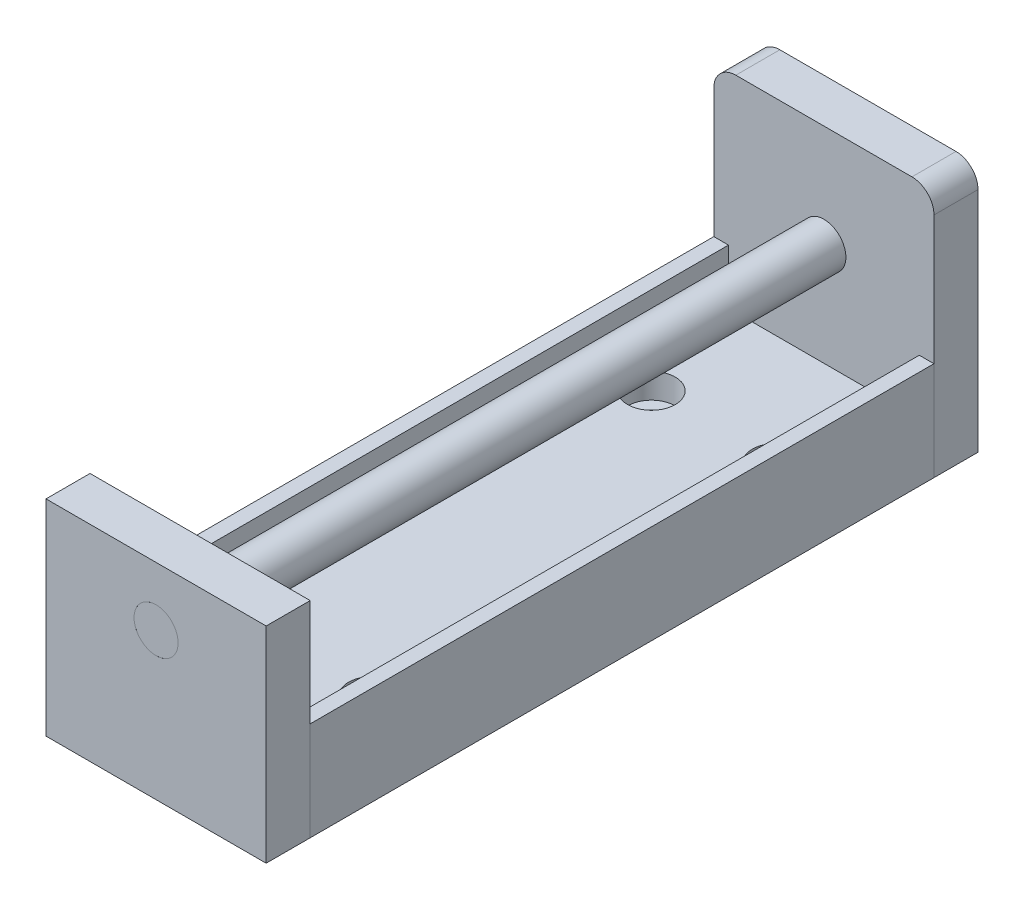
ISO-10303-21;
HEADER;
FILE_DESCRIPTION(('STEP AP214'),'2;1');
FILE_NAME('part.step','',(''),(''),'','','');
FILE_SCHEMA(('AUTOMOTIVE_DESIGN { 1 0 10303 214 1 1 1 1 }'));
ENDSEC;
DATA;
#1=APPLICATION_CONTEXT('core data for automotive mechanical design processes');
#2=APPLICATION_PROTOCOL_DEFINITION('international standard','automotive_design',2000,#1);
#3=PRODUCT_CONTEXT('',#1,'mechanical');
#4=PRODUCT('Part','Part','',(#3));
#5=PRODUCT_RELATED_PRODUCT_CATEGORY('part','',(#4));
#6=PRODUCT_DEFINITION_FORMATION('','',#4);
#7=PRODUCT_DEFINITION_CONTEXT('part definition',#1,'design');
#8=PRODUCT_DEFINITION('design','',#6,#7);
#9=PRODUCT_DEFINITION_SHAPE('','',#8);
#10=(LENGTH_UNIT() NAMED_UNIT(*) SI_UNIT(.MILLI.,.METRE.));
#11=(NAMED_UNIT(*) PLANE_ANGLE_UNIT() SI_UNIT($,.RADIAN.));
#12=(NAMED_UNIT(*) SI_UNIT($,.STERADIAN.) SOLID_ANGLE_UNIT());
#13=UNCERTAINTY_MEASURE_WITH_UNIT(LENGTH_MEASURE(1.E-05),#10,'distance_accuracy_value','');
#14=(GEOMETRIC_REPRESENTATION_CONTEXT(3) GLOBAL_UNCERTAINTY_ASSIGNED_CONTEXT((#13)) GLOBAL_UNIT_ASSIGNED_CONTEXT((#10,
#11,#12)) REPRESENTATION_CONTEXT('',''));
#15=CARTESIAN_POINT('',(0.,0.,0.));
#16=DIRECTION('',(0.,0.,1.));
#17=DIRECTION('',(1.,0.,0.));
#18=AXIS2_PLACEMENT_3D('',#15,#16,#17);
#19=CARTESIAN_POINT('',(0.,0.,6.51471862576143));
#20=DIRECTION('',(0.,0.,1.));
#21=DIRECTION('',(1.,0.,0.));
#22=AXIS2_PLACEMENT_3D('',#19,#20,#21);
#23=CYLINDRICAL_SURFACE('',#22,3.);
#24=CARTESIAN_POINT('',(0.,0.,15.));
#25=DIRECTION('',(0.,0.,1.));
#26=DIRECTION('',(1.,0.,0.));
#27=AXIS2_PLACEMENT_3D('',#24,#25,#26);
#28=CIRCLE('',#27,3.);
#29=CARTESIAN_POINT('',(3.,0.,15.));
#30=VERTEX_POINT('',#29);
#31=EDGE_CURVE('E11',#30,#30,#28,.F.);
#32=ORIENTED_EDGE('',*,*,#31,.F.);
#33=EDGE_LOOP('',(#32));
#34=FACE_BOUND('',#33,.T.);
#35=CARTESIAN_POINT('',(0.,0.,112.));
#36=DIRECTION('',(0.,0.,-1.));
#37=DIRECTION('',(-1.,0.,0.));
#38=AXIS2_PLACEMENT_3D('',#35,#36,#37);
#39=CIRCLE('',#38,3.);
#40=CARTESIAN_POINT('',(-3.,0.,112.));
#41=VERTEX_POINT('',#40);
#42=EDGE_CURVE('E56',#41,#41,#39,.T.);
#43=ORIENTED_EDGE('',*,*,#42,.T.);
#44=EDGE_LOOP('',(#43));
#45=FACE_BOUND('',#44,.T.);
#46=ADVANCED_FACE('F49',(#34,#45),#23,.T.);
#47=CARTESIAN_POINT('',(0.,0.,15.));
#48=DIRECTION('',(0.,0.,1.));
#49=DIRECTION('',(1.,0.,0.));
#50=AXIS2_PLACEMENT_3D('',#47,#48,#49);
#51=PLANE('',#50);
#52=ORIENTED_EDGE('',*,*,#31,.T.);
#53=EDGE_LOOP('',(#52));
#54=FACE_BOUND('',#53,.T.);
#55=ADVANCED_FACE('F66',(#54),#51,.F.);
#56=CARTESIAN_POINT('',(0.,0.,112.));
#57=DIRECTION('',(0.,0.,-1.));
#58=DIRECTION('',(-1.,0.,0.));
#59=AXIS2_PLACEMENT_3D('',#56,#57,#58);
#60=PLANE('',#59);
#61=ORIENTED_EDGE('',*,*,#42,.F.);
#62=EDGE_LOOP('',(#61));
#63=FACE_BOUND('',#62,.T.);
#64=ADVANCED_FACE('F64',(#63),#60,.F.);
#65=CLOSED_SHELL('',(#46,#55,#64));
#66=MANIFOLD_SOLID_BREP('B2',#65);
#67=CARTESIAN_POINT('',(-15.,-20.,112.));
#68=DIRECTION('',(1.,0.,0.));
#69=DIRECTION('',(0.,0.,-1.));
#70=AXIS2_PLACEMENT_3D('',#67,#68,#69);
#71=PLANE('',#70);
#72=DIRECTION('',(0.,-1.,0.));
#73=VECTOR('',#72,1.);
#74=CARTESIAN_POINT('',(-15.,-20.,106.));
#75=LINE('',#74,#73);
#76=CARTESIAN_POINT('',(-15.,8.,106.));
#77=VERTEX_POINT('',#76);
#78=CARTESIAN_POINT('',(-15.,-20.,106.));
#79=VERTEX_POINT('',#78);
#80=EDGE_CURVE('E178',#77,#79,#75,.T.);
#81=ORIENTED_EDGE('',*,*,#80,.T.);
#82=DIRECTION('',(0.,0.,-1.));
#83=VECTOR('',#82,1.);
#84=CARTESIAN_POINT('',(-15.,-20.,112.));
#85=LINE('',#84,#83);
#86=CARTESIAN_POINT('',(-15.,-20.,112.));
#87=VERTEX_POINT('',#86);
#88=EDGE_CURVE('E47',#87,#79,#85,.T.);
#89=ORIENTED_EDGE('',*,*,#88,.F.);
#90=DIRECTION('',(0.,-1.,0.));
#91=VECTOR('',#90,1.);
#92=CARTESIAN_POINT('',(-15.,-20.,112.));
#93=LINE('',#92,#91);
#94=CARTESIAN_POINT('',(-15.,8.,112.));
#95=VERTEX_POINT('',#94);
#96=EDGE_CURVE('E160',#95,#87,#93,.T.);
#97=ORIENTED_EDGE('',*,*,#96,.F.);
#98=DIRECTION('',(0.,0.,-1.));
#99=VECTOR('',#98,1.);
#100=CARTESIAN_POINT('',(-15.,8.,112.));
#101=LINE('',#100,#99);
#102=EDGE_CURVE('E174',#95,#77,#101,.T.);
#103=ORIENTED_EDGE('',*,*,#102,.T.);
#104=EDGE_LOOP('',(#81,#89,#97,#103));
#105=FACE_BOUND('',#104,.T.);
#106=ADVANCED_FACE('F102',(#105),#71,.F.);
#107=CARTESIAN_POINT('',(-15.,-20.,112.));
#108=DIRECTION('',(0.,1.,0.));
#109=DIRECTION('',(0.,0.,1.));
#110=AXIS2_PLACEMENT_3D('',#107,#108,#109);
#111=PLANE('',#110);
#112=DIRECTION('',(1.,0.,0.));
#113=VECTOR('',#112,1.);
#114=CARTESIAN_POINT('',(-15.,-20.,106.));
#115=LINE('',#114,#113);
#116=CARTESIAN_POINT('',(15.,-20.,106.));
#117=VERTEX_POINT('',#116);
#118=EDGE_CURVE('E165',#79,#117,#115,.T.);
#119=ORIENTED_EDGE('',*,*,#118,.T.);
#120=DIRECTION('',(0.,0.,-1.));
#121=VECTOR('',#120,1.);
#122=CARTESIAN_POINT('',(15.,-20.,112.));
#123=LINE('',#122,#121);
#124=CARTESIAN_POINT('',(15.,-20.,112.));
#125=VERTEX_POINT('',#124);
#126=EDGE_CURVE('E112',#125,#117,#123,.T.);
#127=ORIENTED_EDGE('',*,*,#126,.F.);
#128=DIRECTION('',(1.,0.,0.));
#129=VECTOR('',#128,1.);
#130=CARTESIAN_POINT('',(-15.,-20.,112.));
#131=LINE('',#130,#129);
#132=EDGE_CURVE('E155',#87,#125,#131,.T.);
#133=ORIENTED_EDGE('',*,*,#132,.F.);
#134=ORIENTED_EDGE('',*,*,#88,.T.);
#135=EDGE_LOOP('',(#119,#127,#133,#134));
#136=FACE_BOUND('',#135,.T.);
#137=ADVANCED_FACE('F164',(#136),#111,.F.);
#138=CARTESIAN_POINT('',(15.,-20.,112.));
#139=DIRECTION('',(-1.,0.,0.));
#140=DIRECTION('',(0.,0.,1.));
#141=AXIS2_PLACEMENT_3D('',#138,#139,#140);
#142=PLANE('',#141);
#143=DIRECTION('',(0.,1.,0.));
#144=VECTOR('',#143,1.);
#145=CARTESIAN_POINT('',(15.,-20.,106.));
#146=LINE('',#145,#144);
#147=CARTESIAN_POINT('',(15.,8.,106.));
#148=VERTEX_POINT('',#147);
#149=EDGE_CURVE('E142',#117,#148,#146,.T.);
#150=ORIENTED_EDGE('',*,*,#149,.T.);
#151=DIRECTION('',(0.,0.,-1.));
#152=VECTOR('',#151,1.);
#153=CARTESIAN_POINT('',(15.,8.,112.));
#154=LINE('',#153,#152);
#155=CARTESIAN_POINT('',(15.,8.,112.));
#156=VERTEX_POINT('',#155);
#157=EDGE_CURVE('E166',#156,#148,#154,.T.);
#158=ORIENTED_EDGE('',*,*,#157,.F.);
#159=DIRECTION('',(0.,1.,0.));
#160=VECTOR('',#159,1.);
#161=CARTESIAN_POINT('',(15.,-20.,112.));
#162=LINE('',#161,#160);
#163=EDGE_CURVE('E158',#125,#156,#162,.T.);
#164=ORIENTED_EDGE('',*,*,#163,.F.);
#165=ORIENTED_EDGE('',*,*,#126,.T.);
#166=EDGE_LOOP('',(#150,#158,#164,#165));
#167=FACE_BOUND('',#166,.T.);
#168=ADVANCED_FACE('F168',(#167),#142,.F.);
#169=CARTESIAN_POINT('',(-15.,8.,112.));
#170=DIRECTION('',(0.,-1.,0.));
#171=DIRECTION('',(0.,0.,-1.));
#172=AXIS2_PLACEMENT_3D('',#169,#170,#171);
#173=PLANE('',#172);
#174=DIRECTION('',(-1.,0.,0.));
#175=VECTOR('',#174,1.);
#176=CARTESIAN_POINT('',(-15.,8.,106.));
#177=LINE('',#176,#175);
#178=EDGE_CURVE('E148',#148,#77,#177,.T.);
#179=ORIENTED_EDGE('',*,*,#178,.T.);
#180=ORIENTED_EDGE('',*,*,#102,.F.);
#181=DIRECTION('',(-1.,0.,0.));
#182=VECTOR('',#181,1.);
#183=CARTESIAN_POINT('',(-15.,8.,112.));
#184=LINE('',#183,#182);
#185=EDGE_CURVE('E122',#156,#95,#184,.T.);
#186=ORIENTED_EDGE('',*,*,#185,.F.);
#187=ORIENTED_EDGE('',*,*,#157,.T.);
#188=EDGE_LOOP('',(#179,#180,#186,#187));
#189=FACE_BOUND('',#188,.T.);
#190=ADVANCED_FACE('F189',(#189),#173,.F.);
#191=CARTESIAN_POINT('',(0.,0.,112.));
#192=DIRECTION('',(0.,0.,-1.));
#193=DIRECTION('',(-1.,0.,0.));
#194=AXIS2_PLACEMENT_3D('',#191,#192,#193);
#195=PLANE('',#194);
#196=CARTESIAN_POINT('',(0.,0.,112.));
#197=DIRECTION('',(0.,0.,1.));
#198=DIRECTION('',(1.,0.,0.));
#199=AXIS2_PLACEMENT_3D('',#196,#197,#198);
#200=CIRCLE('',#199,3.);
#201=CARTESIAN_POINT('',(3.,0.,112.));
#202=VERTEX_POINT('',#201);
#203=EDGE_CURVE('E196',#202,#202,#200,.T.);
#204=ORIENTED_EDGE('',*,*,#203,.F.);
#205=EDGE_LOOP('',(#204));
#206=FACE_BOUND('',#205,.T.);
#207=ORIENTED_EDGE('',*,*,#96,.T.);
#208=ORIENTED_EDGE('',*,*,#132,.T.);
#209=ORIENTED_EDGE('',*,*,#163,.T.);
#210=ORIENTED_EDGE('',*,*,#185,.T.);
#211=EDGE_LOOP('',(#207,#208,#209,#210));
#212=FACE_BOUND('',#211,.T.);
#213=ADVANCED_FACE('F156',(#206,#212),#195,.F.);
#214=CARTESIAN_POINT('',(0.,0.,106.));
#215=DIRECTION('',(0.,0.,-1.));
#216=DIRECTION('',(-1.,0.,0.));
#217=AXIS2_PLACEMENT_3D('',#214,#215,#216);
#218=PLANE('',#217);
#219=CARTESIAN_POINT('',(0.,0.,106.));
#220=DIRECTION('',(0.,0.,-1.));
#221=DIRECTION('',(-1.,0.,0.));
#222=AXIS2_PLACEMENT_3D('',#219,#220,#221);
#223=CIRCLE('',#222,3.);
#224=CARTESIAN_POINT('',(-3.,0.,106.));
#225=VERTEX_POINT('',#224);
#226=EDGE_CURVE('E105',#225,#225,#223,.T.);
#227=ORIENTED_EDGE('',*,*,#226,.F.);
#228=EDGE_LOOP('',(#227));
#229=FACE_BOUND('',#228,.T.);
#230=ORIENTED_EDGE('',*,*,#80,.F.);
#231=ORIENTED_EDGE('',*,*,#178,.F.);
#232=ORIENTED_EDGE('',*,*,#149,.F.);
#233=ORIENTED_EDGE('',*,*,#118,.F.);
#234=EDGE_LOOP('',(#230,#231,#232,#233));
#235=FACE_BOUND('',#234,.T.);
#236=ADVANCED_FACE('F192',(#229,#235),#218,.T.);
#237=CARTESIAN_POINT('',(0.,0.,15.));
#238=DIRECTION('',(0.,0.,1.));
#239=DIRECTION('',(1.,0.,0.));
#240=AXIS2_PLACEMENT_3D('',#237,#238,#239);
#241=CYLINDRICAL_SURFACE('',#240,3.);
#242=ORIENTED_EDGE('',*,*,#226,.T.);
#243=EDGE_LOOP('',(#242));
#244=FACE_BOUND('',#243,.T.);
#245=ORIENTED_EDGE('',*,*,#203,.T.);
#246=EDGE_LOOP('',(#245));
#247=FACE_BOUND('',#246,.T.);
#248=ADVANCED_FACE('F205',(#244,#247),#241,.F.);
#249=CLOSED_SHELL('',(#106,#137,#168,#190,#213,#236,#248));
#250=MANIFOLD_SOLID_BREP('B6',#249);
#251=CARTESIAN_POINT('',(-15.,-20.,106.));
#252=DIRECTION('',(1.,0.,0.));
#253=DIRECTION('',(0.,1.,0.));
#254=AXIS2_PLACEMENT_3D('',#251,#252,#253);
#255=PLANE('',#254);
#256=DIRECTION('',(0.,-1.,0.));
#257=VECTOR('',#256,1.);
#258=CARTESIAN_POINT('',(-15.,-20.,21.));
#259=LINE('',#258,#257);
#260=CARTESIAN_POINT('',(-15.,-6.55,21.));
#261=VERTEX_POINT('',#260);
#262=CARTESIAN_POINT('',(-15.,-20.,21.));
#263=VERTEX_POINT('',#262);
#264=EDGE_CURVE('E388',#261,#263,#259,.T.);
#265=ORIENTED_EDGE('',*,*,#264,.T.);
#266=DIRECTION('',(0.,0.,-1.));
#267=VECTOR('',#266,1.);
#268=CARTESIAN_POINT('',(-15.,-20.,106.));
#269=LINE('',#268,#267);
#270=CARTESIAN_POINT('',(-15.,-20.,106.));
#271=VERTEX_POINT('',#270);
#272=EDGE_CURVE('E100',#271,#263,#269,.T.);
#273=ORIENTED_EDGE('',*,*,#272,.F.);
#274=DIRECTION('',(0.,-1.,0.));
#275=VECTOR('',#274,1.);
#276=CARTESIAN_POINT('',(-15.,-20.,106.));
#277=LINE('',#276,#275);
#278=CARTESIAN_POINT('',(-15.,-6.55,106.));
#279=VERTEX_POINT('',#278);
#280=EDGE_CURVE('E410',#279,#271,#277,.T.);
#281=ORIENTED_EDGE('',*,*,#280,.F.);
#282=DIRECTION('',(0.,0.,-1.));
#283=VECTOR('',#282,1.);
#284=CARTESIAN_POINT('',(-15.,-6.55,106.));
#285=LINE('',#284,#283);
#286=EDGE_CURVE('E384',#279,#261,#285,.T.);
#287=ORIENTED_EDGE('',*,*,#286,.T.);
#288=EDGE_LOOP('',(#265,#273,#281,#287));
#289=FACE_BOUND('',#288,.T.);
#290=ADVANCED_FACE('F275',(#289),#255,.F.);
#291=CARTESIAN_POINT('',(15.,-20.,106.));
#292=DIRECTION('',(0.,1.,0.));
#293=DIRECTION('',(0.,0.,1.));
#294=AXIS2_PLACEMENT_3D('',#291,#292,#293);
#295=PLANE('',#294);
#296=CARTESIAN_POINT('',(-8.5,-20.,36.));
#297=DIRECTION('',(0.,1.,0.));
#298=DIRECTION('',(0.,0.,1.));
#299=AXIS2_PLACEMENT_3D('',#296,#297,#298);
#300=CIRCLE('',#299,1.6);
#301=CARTESIAN_POINT('',(-8.5,-20.,37.6));
#302=VERTEX_POINT('',#301);
#303=EDGE_CURVE('E499',#302,#302,#300,.T.);
#304=ORIENTED_EDGE('',*,*,#303,.T.);
#305=EDGE_LOOP('',(#304));
#306=FACE_BOUND('',#305,.T.);
#307=CARTESIAN_POINT('',(8.50000000000001,-20.,36.));
#308=DIRECTION('',(0.,1.,0.));
#309=DIRECTION('',(0.,0.,1.));
#310=AXIS2_PLACEMENT_3D('',#307,#308,#309);
#311=CIRCLE('',#310,1.6);
#312=CARTESIAN_POINT('',(8.50000000000001,-20.,37.6));
#313=VERTEX_POINT('',#312);
#314=EDGE_CURVE('E486',#313,#313,#311,.T.);
#315=ORIENTED_EDGE('',*,*,#314,.T.);
#316=EDGE_LOOP('',(#315));
#317=FACE_BOUND('',#316,.T.);
#318=CARTESIAN_POINT('',(8.50000000000001,-20.,91.));
#319=DIRECTION('',(0.,1.,0.));
#320=DIRECTION('',(0.,0.,1.));
#321=AXIS2_PLACEMENT_3D('',#318,#319,#320);
#322=CIRCLE('',#321,1.6);
#323=CARTESIAN_POINT('',(8.50000000000001,-20.,92.6));
#324=VERTEX_POINT('',#323);
#325=EDGE_CURVE('E470',#324,#324,#322,.T.);
#326=ORIENTED_EDGE('',*,*,#325,.T.);
#327=EDGE_LOOP('',(#326));
#328=FACE_BOUND('',#327,.T.);
#329=CARTESIAN_POINT('',(-8.49999999999999,-20.,91.));
#330=DIRECTION('',(0.,1.,0.));
#331=DIRECTION('',(0.,0.,1.));
#332=AXIS2_PLACEMENT_3D('',#329,#330,#331);
#333=CIRCLE('',#332,1.6);
#334=CARTESIAN_POINT('',(-8.49999999999999,-20.,92.6));
#335=VERTEX_POINT('',#334);
#336=EDGE_CURVE('E393',#335,#335,#333,.T.);
#337=ORIENTED_EDGE('',*,*,#336,.T.);
#338=EDGE_LOOP('',(#337));
#339=FACE_BOUND('',#338,.T.);
#340=DIRECTION('',(1.,0.,0.));
#341=VECTOR('',#340,1.);
#342=CARTESIAN_POINT('',(15.,-20.,21.));
#343=LINE('',#342,#341);
#344=CARTESIAN_POINT('',(15.,-20.,21.));
#345=VERTEX_POINT('',#344);
#346=EDGE_CURVE('E392',#263,#345,#343,.T.);
#347=ORIENTED_EDGE('',*,*,#346,.T.);
#348=DIRECTION('',(0.,0.,-1.));
#349=VECTOR('',#348,1.);
#350=CARTESIAN_POINT('',(15.,-20.,106.));
#351=LINE('',#350,#349);
#352=CARTESIAN_POINT('',(15.,-20.,106.));
#353=VERTEX_POINT('',#352);
#354=EDGE_CURVE('E284',#353,#345,#351,.T.);
#355=ORIENTED_EDGE('',*,*,#354,.F.);
#356=DIRECTION('',(1.,0.,0.));
#357=VECTOR('',#356,1.);
#358=CARTESIAN_POINT('',(15.,-20.,106.));
#359=LINE('',#358,#357);
#360=EDGE_CURVE('E345',#271,#353,#359,.T.);
#361=ORIENTED_EDGE('',*,*,#360,.F.);
#362=ORIENTED_EDGE('',*,*,#272,.T.);
#363=EDGE_LOOP('',(#347,#355,#361,#362));
#364=FACE_BOUND('',#363,.T.);
#365=ADVANCED_FACE('F541',(#306,#317,#328,#339,#364),#295,.F.);
#366=CARTESIAN_POINT('',(15.,-6.55,106.));
#367=DIRECTION('',(-1.,0.,0.));
#368=DIRECTION('',(0.,0.,1.));
#369=AXIS2_PLACEMENT_3D('',#366,#367,#368);
#370=PLANE('',#369);
#371=DIRECTION('',(0.,1.,0.));
#372=VECTOR('',#371,1.);
#373=CARTESIAN_POINT('',(15.,-6.55,21.));
#374=LINE('',#373,#372);
#375=CARTESIAN_POINT('',(15.,-6.55,21.));
#376=VERTEX_POINT('',#375);
#377=EDGE_CURVE('E395',#345,#376,#374,.T.);
#378=ORIENTED_EDGE('',*,*,#377,.T.);
#379=DIRECTION('',(0.,0.,-1.));
#380=VECTOR('',#379,1.);
#381=CARTESIAN_POINT('',(15.,-6.55,106.));
#382=LINE('',#381,#380);
#383=CARTESIAN_POINT('',(15.,-6.55,106.));
#384=VERTEX_POINT('',#383);
#385=EDGE_CURVE('E421',#384,#376,#382,.T.);
#386=ORIENTED_EDGE('',*,*,#385,.F.);
#387=DIRECTION('',(0.,1.,0.));
#388=VECTOR('',#387,1.);
#389=CARTESIAN_POINT('',(15.,-6.55,106.));
#390=LINE('',#389,#388);
#391=EDGE_CURVE('E433',#353,#384,#390,.T.);
#392=ORIENTED_EDGE('',*,*,#391,.F.);
#393=ORIENTED_EDGE('',*,*,#354,.T.);
#394=EDGE_LOOP('',(#378,#386,#392,#393));
#395=FACE_BOUND('',#394,.T.);
#396=ADVANCED_FACE('F431',(#395),#370,.F.);
#397=CARTESIAN_POINT('',(13.,-6.55,106.));
#398=DIRECTION('',(0.,-1.,0.));
#399=DIRECTION('',(0.,0.,-1.));
#400=AXIS2_PLACEMENT_3D('',#397,#398,#399);
#401=PLANE('',#400);
#402=DIRECTION('',(-1.,0.,0.));
#403=VECTOR('',#402,1.);
#404=CARTESIAN_POINT('',(13.,-6.55,21.));
#405=LINE('',#404,#403);
#406=CARTESIAN_POINT('',(13.,-6.55,21.));
#407=VERTEX_POINT('',#406);
#408=EDGE_CURVE('E398',#376,#407,#405,.T.);
#409=ORIENTED_EDGE('',*,*,#408,.T.);
#410=DIRECTION('',(0.,0.,-1.));
#411=VECTOR('',#410,1.);
#412=CARTESIAN_POINT('',(13.,-6.55,106.));
#413=LINE('',#412,#411);
#414=CARTESIAN_POINT('',(13.,-6.55,106.));
#415=VERTEX_POINT('',#414);
#416=EDGE_CURVE('E417',#415,#407,#413,.T.);
#417=ORIENTED_EDGE('',*,*,#416,.F.);
#418=DIRECTION('',(-1.,0.,0.));
#419=VECTOR('',#418,1.);
#420=CARTESIAN_POINT('',(13.,-6.55,106.));
#421=LINE('',#420,#419);
#422=EDGE_CURVE('E446',#384,#415,#421,.T.);
#423=ORIENTED_EDGE('',*,*,#422,.F.);
#424=ORIENTED_EDGE('',*,*,#385,.T.);
#425=EDGE_LOOP('',(#409,#417,#423,#424));
#426=FACE_BOUND('',#425,.T.);
#427=ADVANCED_FACE('F441',(#426),#401,.F.);
#428=CARTESIAN_POINT('',(13.,-14.,106.));
#429=DIRECTION('',(1.,0.,0.));
#430=DIRECTION('',(0.,1.,0.));
#431=AXIS2_PLACEMENT_3D('',#428,#429,#430);
#432=PLANE('',#431);
#433=DIRECTION('',(0.,-1.,0.));
#434=VECTOR('',#433,1.);
#435=CARTESIAN_POINT('',(13.,-14.,21.));
#436=LINE('',#435,#434);
#437=CARTESIAN_POINT('',(13.,-14.,21.));
#438=VERTEX_POINT('',#437);
#439=EDGE_CURVE('E401',#407,#438,#436,.T.);
#440=ORIENTED_EDGE('',*,*,#439,.T.);
#441=DIRECTION('',(0.,0.,-1.));
#442=VECTOR('',#441,1.);
#443=CARTESIAN_POINT('',(13.,-14.,106.));
#444=LINE('',#443,#442);
#445=CARTESIAN_POINT('',(13.,-14.,106.));
#446=VERTEX_POINT('',#445);
#447=EDGE_CURVE('E377',#446,#438,#444,.T.);
#448=ORIENTED_EDGE('',*,*,#447,.F.);
#449=DIRECTION('',(0.,-1.,0.));
#450=VECTOR('',#449,1.);
#451=CARTESIAN_POINT('',(13.,-14.,106.));
#452=LINE('',#451,#450);
#453=EDGE_CURVE('E366',#415,#446,#452,.T.);
#454=ORIENTED_EDGE('',*,*,#453,.F.);
#455=ORIENTED_EDGE('',*,*,#416,.T.);
#456=EDGE_LOOP('',(#440,#448,#454,#455));
#457=FACE_BOUND('',#456,.T.);
#458=ADVANCED_FACE('F444',(#457),#432,.F.);
#459=CARTESIAN_POINT('',(-13.,-14.,106.));
#460=DIRECTION('',(0.,-1.,0.));
#461=DIRECTION('',(0.,0.,-1.));
#462=AXIS2_PLACEMENT_3D('',#459,#460,#461);
#463=PLANE('',#462);
#464=CARTESIAN_POINT('',(-8.5,-14.,36.));
#465=DIRECTION('',(0.,1.,0.));
#466=DIRECTION('',(0.,0.,1.));
#467=AXIS2_PLACEMENT_3D('',#464,#465,#466);
#468=CIRCLE('',#467,3.25);
#469=CARTESIAN_POINT('',(-8.5,-14.,39.25));
#470=VERTEX_POINT('',#469);
#471=EDGE_CURVE('E508',#470,#470,#468,.T.);
#472=ORIENTED_EDGE('',*,*,#471,.F.);
#473=EDGE_LOOP('',(#472));
#474=FACE_BOUND('',#473,.T.);
#475=CARTESIAN_POINT('',(8.50000000000001,-14.,36.));
#476=DIRECTION('',(0.,1.,0.));
#477=DIRECTION('',(0.,0.,1.));
#478=AXIS2_PLACEMENT_3D('',#475,#476,#477);
#479=CIRCLE('',#478,3.25);
#480=CARTESIAN_POINT('',(8.50000000000001,-14.,39.25));
#481=VERTEX_POINT('',#480);
#482=EDGE_CURVE('E495',#481,#481,#479,.T.);
#483=ORIENTED_EDGE('',*,*,#482,.F.);
#484=EDGE_LOOP('',(#483));
#485=FACE_BOUND('',#484,.T.);
#486=CARTESIAN_POINT('',(8.50000000000001,-14.,91.));
#487=DIRECTION('',(0.,1.,0.));
#488=DIRECTION('',(0.,0.,1.));
#489=AXIS2_PLACEMENT_3D('',#486,#487,#488);
#490=CIRCLE('',#489,3.25);
#491=CARTESIAN_POINT('',(8.50000000000001,-14.,94.25));
#492=VERTEX_POINT('',#491);
#493=EDGE_CURVE('E482',#492,#492,#490,.T.);
#494=ORIENTED_EDGE('',*,*,#493,.F.);
#495=EDGE_LOOP('',(#494));
#496=FACE_BOUND('',#495,.T.);
#497=CARTESIAN_POINT('',(-8.49999999999999,-14.,91.));
#498=DIRECTION('',(0.,1.,0.));
#499=DIRECTION('',(0.,0.,1.));
#500=AXIS2_PLACEMENT_3D('',#497,#498,#499);
#501=CIRCLE('',#500,3.25);
#502=CARTESIAN_POINT('',(-8.49999999999999,-14.,94.25));
#503=VERTEX_POINT('',#502);
#504=EDGE_CURVE('E467',#503,#503,#501,.T.);
#505=ORIENTED_EDGE('',*,*,#504,.F.);
#506=EDGE_LOOP('',(#505));
#507=FACE_BOUND('',#506,.T.);
#508=DIRECTION('',(-1.,0.,0.));
#509=VECTOR('',#508,1.);
#510=CARTESIAN_POINT('',(-13.,-14.,21.));
#511=LINE('',#510,#509);
#512=CARTESIAN_POINT('',(-13.,-14.,21.));
#513=VERTEX_POINT('',#512);
#514=EDGE_CURVE('E375',#438,#513,#511,.T.);
#515=ORIENTED_EDGE('',*,*,#514,.T.);
#516=DIRECTION('',(0.,0.,-1.));
#517=VECTOR('',#516,1.);
#518=CARTESIAN_POINT('',(-13.,-14.,106.));
#519=LINE('',#518,#517);
#520=CARTESIAN_POINT('',(-13.,-14.,106.));
#521=VERTEX_POINT('',#520);
#522=EDGE_CURVE('E372',#521,#513,#519,.T.);
#523=ORIENTED_EDGE('',*,*,#522,.F.);
#524=DIRECTION('',(-1.,0.,0.));
#525=VECTOR('',#524,1.);
#526=CARTESIAN_POINT('',(-13.,-14.,106.));
#527=LINE('',#526,#525);
#528=EDGE_CURVE('E360',#446,#521,#527,.T.);
#529=ORIENTED_EDGE('',*,*,#528,.F.);
#530=ORIENTED_EDGE('',*,*,#447,.T.);
#531=EDGE_LOOP('',(#515,#523,#529,#530));
#532=FACE_BOUND('',#531,.T.);
#533=ADVANCED_FACE('F373',(#474,#485,#496,#507,#532),#463,.F.);
#534=CARTESIAN_POINT('',(-13.,-6.55,106.));
#535=DIRECTION('',(-1.,0.,0.));
#536=DIRECTION('',(0.,-1.,0.));
#537=AXIS2_PLACEMENT_3D('',#534,#535,#536);
#538=PLANE('',#537);
#539=DIRECTION('',(0.,1.,0.));
#540=VECTOR('',#539,1.);
#541=CARTESIAN_POINT('',(-13.,-6.55,21.));
#542=LINE('',#541,#540);
#543=CARTESIAN_POINT('',(-13.,-6.55,21.));
#544=VERTEX_POINT('',#543);
#545=EDGE_CURVE('E329',#513,#544,#542,.T.);
#546=ORIENTED_EDGE('',*,*,#545,.T.);
#547=DIRECTION('',(0.,0.,-1.));
#548=VECTOR('',#547,1.);
#549=CARTESIAN_POINT('',(-13.,-6.55,106.));
#550=LINE('',#549,#548);
#551=CARTESIAN_POINT('',(-13.,-6.55,106.));
#552=VERTEX_POINT('',#551);
#553=EDGE_CURVE('E378',#552,#544,#550,.T.);
#554=ORIENTED_EDGE('',*,*,#553,.F.);
#555=DIRECTION('',(0.,1.,0.));
#556=VECTOR('',#555,1.);
#557=CARTESIAN_POINT('',(-13.,-6.55,106.));
#558=LINE('',#557,#556);
#559=EDGE_CURVE('E364',#521,#552,#558,.T.);
#560=ORIENTED_EDGE('',*,*,#559,.F.);
#561=ORIENTED_EDGE('',*,*,#522,.T.);
#562=EDGE_LOOP('',(#546,#554,#560,#561));
#563=FACE_BOUND('',#562,.T.);
#564=ADVANCED_FACE('F380',(#563),#538,.F.);
#565=CARTESIAN_POINT('',(-15.,-6.55,106.));
#566=DIRECTION('',(0.,-1.,0.));
#567=DIRECTION('',(0.,0.,-1.));
#568=AXIS2_PLACEMENT_3D('',#565,#566,#567);
#569=PLANE('',#568);
#570=DIRECTION('',(-1.,0.,0.));
#571=VECTOR('',#570,1.);
#572=CARTESIAN_POINT('',(-15.,-6.55,21.));
#573=LINE('',#572,#571);
#574=EDGE_CURVE('E336',#544,#261,#573,.T.);
#575=ORIENTED_EDGE('',*,*,#574,.T.);
#576=ORIENTED_EDGE('',*,*,#286,.F.);
#577=DIRECTION('',(-1.,0.,0.));
#578=VECTOR('',#577,1.);
#579=CARTESIAN_POINT('',(-15.,-6.55,106.));
#580=LINE('',#579,#578);
#581=EDGE_CURVE('E295',#552,#279,#580,.T.);
#582=ORIENTED_EDGE('',*,*,#581,.F.);
#583=ORIENTED_EDGE('',*,*,#553,.T.);
#584=EDGE_LOOP('',(#575,#576,#582,#583));
#585=FACE_BOUND('',#584,.T.);
#586=ADVANCED_FACE('F549',(#585),#569,.F.);
#587=CARTESIAN_POINT('',(0.,0.,106.));
#588=DIRECTION('',(0.,0.,-1.));
#589=DIRECTION('',(-1.,0.,0.));
#590=AXIS2_PLACEMENT_3D('',#587,#588,#589);
#591=PLANE('',#590);
#592=ORIENTED_EDGE('',*,*,#280,.T.);
#593=ORIENTED_EDGE('',*,*,#360,.T.);
#594=ORIENTED_EDGE('',*,*,#391,.T.);
#595=ORIENTED_EDGE('',*,*,#422,.T.);
#596=ORIENTED_EDGE('',*,*,#453,.T.);
#597=ORIENTED_EDGE('',*,*,#528,.T.);
#598=ORIENTED_EDGE('',*,*,#559,.T.);
#599=ORIENTED_EDGE('',*,*,#581,.T.);
#600=EDGE_LOOP('',(#592,#593,#594,#595,#596,#597,#598,#599));
#601=FACE_BOUND('',#600,.T.);
#602=ADVANCED_FACE('F362',(#601),#591,.F.);
#603=CARTESIAN_POINT('',(0.,0.,21.));
#604=DIRECTION('',(0.,0.,-1.));
#605=DIRECTION('',(-1.,0.,0.));
#606=AXIS2_PLACEMENT_3D('',#603,#604,#605);
#607=PLANE('',#606);
#608=ORIENTED_EDGE('',*,*,#264,.F.);
#609=ORIENTED_EDGE('',*,*,#574,.F.);
#610=ORIENTED_EDGE('',*,*,#545,.F.);
#611=ORIENTED_EDGE('',*,*,#514,.F.);
#612=ORIENTED_EDGE('',*,*,#439,.F.);
#613=ORIENTED_EDGE('',*,*,#408,.F.);
#614=ORIENTED_EDGE('',*,*,#377,.F.);
#615=ORIENTED_EDGE('',*,*,#346,.F.);
#616=EDGE_LOOP('',(#608,#609,#610,#611,#612,#613,#614,#615));
#617=FACE_BOUND('',#616,.T.);
#618=ADVANCED_FACE('F437',(#617),#607,.T.);
#619=CARTESIAN_POINT('',(-8.49999999999999,-14.,91.));
#620=DIRECTION('',(0.,1.,0.));
#621=DIRECTION('',(0.,0.,1.));
#622=AXIS2_PLACEMENT_3D('',#619,#620,#621);
#623=CYLINDRICAL_SURFACE('',#622,1.6);
#624=ORIENTED_EDGE('',*,*,#336,.F.);
#625=EDGE_LOOP('',(#624));
#626=FACE_BOUND('',#625,.T.);
#627=CARTESIAN_POINT('',(-8.49999999999999,-17.4,91.));
#628=DIRECTION('',(0.,1.,0.));
#629=DIRECTION('',(0.,0.,1.));
#630=AXIS2_PLACEMENT_3D('',#627,#628,#629);
#631=CIRCLE('',#630,1.6);
#632=CARTESIAN_POINT('',(-8.49999999999999,-17.4,92.6));
#633=VERTEX_POINT('',#632);
#634=EDGE_CURVE('E459',#633,#633,#631,.T.);
#635=ORIENTED_EDGE('',*,*,#634,.T.);
#636=EDGE_LOOP('',(#635));
#637=FACE_BOUND('',#636,.T.);
#638=ADVANCED_FACE('F536',(#626,#637),#623,.F.);
#639=CARTESIAN_POINT('',(-6.89999999999999,-17.4,91.));
#640=DIRECTION('',(0.,-1.,0.));
#641=DIRECTION('',(0.,0.,-1.));
#642=AXIS2_PLACEMENT_3D('',#639,#640,#641);
#643=PLANE('',#642);
#644=ORIENTED_EDGE('',*,*,#634,.F.);
#645=EDGE_LOOP('',(#644));
#646=FACE_BOUND('',#645,.T.);
#647=CARTESIAN_POINT('',(-8.49999999999999,-17.4,91.));
#648=DIRECTION('',(0.,1.,0.));
#649=DIRECTION('',(0.,0.,1.));
#650=AXIS2_PLACEMENT_3D('',#647,#648,#649);
#651=CIRCLE('',#650,3.25);
#652=CARTESIAN_POINT('',(-8.49999999999999,-17.4,94.25));
#653=VERTEX_POINT('',#652);
#654=EDGE_CURVE('E463',#653,#653,#651,.T.);
#655=ORIENTED_EDGE('',*,*,#654,.T.);
#656=EDGE_LOOP('',(#655));
#657=FACE_BOUND('',#656,.T.);
#658=ADVANCED_FACE('F526',(#646,#657),#643,.F.);
#659=CARTESIAN_POINT('',(-8.49999999999999,-14.,91.));
#660=DIRECTION('',(0.,1.,0.));
#661=DIRECTION('',(0.,0.,1.));
#662=AXIS2_PLACEMENT_3D('',#659,#660,#661);
#663=CYLINDRICAL_SURFACE('',#662,3.25);
#664=ORIENTED_EDGE('',*,*,#654,.F.);
#665=EDGE_LOOP('',(#664));
#666=FACE_BOUND('',#665,.T.);
#667=ORIENTED_EDGE('',*,*,#504,.T.);
#668=EDGE_LOOP('',(#667));
#669=FACE_BOUND('',#668,.T.);
#670=ADVANCED_FACE('F523',(#666,#669),#663,.F.);
#671=CARTESIAN_POINT('',(8.50000000000001,-14.,91.));
#672=DIRECTION('',(0.,1.,0.));
#673=DIRECTION('',(0.,0.,1.));
#674=AXIS2_PLACEMENT_3D('',#671,#672,#673);
#675=CYLINDRICAL_SURFACE('',#674,1.6);
#676=ORIENTED_EDGE('',*,*,#325,.F.);
#677=EDGE_LOOP('',(#676));
#678=FACE_BOUND('',#677,.T.);
#679=CARTESIAN_POINT('',(8.50000000000001,-17.4,91.));
#680=DIRECTION('',(0.,1.,0.));
#681=DIRECTION('',(0.,0.,1.));
#682=AXIS2_PLACEMENT_3D('',#679,#680,#681);
#683=CIRCLE('',#682,1.6);
#684=CARTESIAN_POINT('',(8.50000000000001,-17.4,92.6));
#685=VERTEX_POINT('',#684);
#686=EDGE_CURVE('E474',#685,#685,#683,.T.);
#687=ORIENTED_EDGE('',*,*,#686,.T.);
#688=EDGE_LOOP('',(#687));
#689=FACE_BOUND('',#688,.T.);
#690=ADVANCED_FACE('F525',(#678,#689),#675,.F.);
#691=CARTESIAN_POINT('',(10.1,-17.4,91.));
#692=DIRECTION('',(0.,-1.,0.));
#693=DIRECTION('',(0.,0.,-1.));
#694=AXIS2_PLACEMENT_3D('',#691,#692,#693);
#695=PLANE('',#694);
#696=ORIENTED_EDGE('',*,*,#686,.F.);
#697=EDGE_LOOP('',(#696));
#698=FACE_BOUND('',#697,.T.);
#699=CARTESIAN_POINT('',(8.50000000000001,-17.4,91.));
#700=DIRECTION('',(0.,1.,0.));
#701=DIRECTION('',(0.,0.,1.));
#702=AXIS2_PLACEMENT_3D('',#699,#700,#701);
#703=CIRCLE('',#702,3.25);
#704=CARTESIAN_POINT('',(8.50000000000001,-17.4,94.25));
#705=VERTEX_POINT('',#704);
#706=EDGE_CURVE('E478',#705,#705,#703,.T.);
#707=ORIENTED_EDGE('',*,*,#706,.T.);
#708=EDGE_LOOP('',(#707));
#709=FACE_BOUND('',#708,.T.);
#710=ADVANCED_FACE('F533',(#698,#709),#695,.F.);
#711=CARTESIAN_POINT('',(8.50000000000001,-14.,91.));
#712=DIRECTION('',(0.,1.,0.));
#713=DIRECTION('',(0.,0.,1.));
#714=AXIS2_PLACEMENT_3D('',#711,#712,#713);
#715=CYLINDRICAL_SURFACE('',#714,3.25);
#716=ORIENTED_EDGE('',*,*,#706,.F.);
#717=EDGE_LOOP('',(#716));
#718=FACE_BOUND('',#717,.T.);
#719=ORIENTED_EDGE('',*,*,#493,.T.);
#720=EDGE_LOOP('',(#719));
#721=FACE_BOUND('',#720,.T.);
#722=ADVANCED_FACE('F653',(#718,#721),#715,.F.);
#723=CARTESIAN_POINT('',(8.50000000000001,-14.,36.));
#724=DIRECTION('',(0.,1.,0.));
#725=DIRECTION('',(0.,0.,1.));
#726=AXIS2_PLACEMENT_3D('',#723,#724,#725);
#727=CYLINDRICAL_SURFACE('',#726,1.6);
#728=ORIENTED_EDGE('',*,*,#314,.F.);
#729=EDGE_LOOP('',(#728));
#730=FACE_BOUND('',#729,.T.);
#731=CARTESIAN_POINT('',(8.50000000000001,-17.4,36.));
#732=DIRECTION('',(0.,1.,0.));
#733=DIRECTION('',(0.,0.,1.));
#734=AXIS2_PLACEMENT_3D('',#731,#732,#733);
#735=CIRCLE('',#734,1.6);
#736=CARTESIAN_POINT('',(8.50000000000001,-17.4,37.6));
#737=VERTEX_POINT('',#736);
#738=EDGE_CURVE('E489',#737,#737,#735,.T.);
#739=ORIENTED_EDGE('',*,*,#738,.T.);
#740=EDGE_LOOP('',(#739));
#741=FACE_BOUND('',#740,.T.);
#742=ADVANCED_FACE('F662',(#730,#741),#727,.F.);
#743=CARTESIAN_POINT('',(10.1,-17.4,36.));
#744=DIRECTION('',(0.,-1.,0.));
#745=DIRECTION('',(0.,0.,-1.));
#746=AXIS2_PLACEMENT_3D('',#743,#744,#745);
#747=PLANE('',#746);
#748=ORIENTED_EDGE('',*,*,#738,.F.);
#749=EDGE_LOOP('',(#748));
#750=FACE_BOUND('',#749,.T.);
#751=CARTESIAN_POINT('',(8.50000000000001,-17.4,36.));
#752=DIRECTION('',(0.,1.,0.));
#753=DIRECTION('',(0.,0.,1.));
#754=AXIS2_PLACEMENT_3D('',#751,#752,#753);
#755=CIRCLE('',#754,3.25);
#756=CARTESIAN_POINT('',(8.50000000000001,-17.4,39.25));
#757=VERTEX_POINT('',#756);
#758=EDGE_CURVE('E492',#757,#757,#755,.T.);
#759=ORIENTED_EDGE('',*,*,#758,.T.);
#760=EDGE_LOOP('',(#759));
#761=FACE_BOUND('',#760,.T.);
#762=ADVANCED_FACE('F671',(#750,#761),#747,.F.);
#763=CARTESIAN_POINT('',(8.50000000000001,-14.,36.));
#764=DIRECTION('',(0.,1.,0.));
#765=DIRECTION('',(0.,0.,1.));
#766=AXIS2_PLACEMENT_3D('',#763,#764,#765);
#767=CYLINDRICAL_SURFACE('',#766,3.25);
#768=ORIENTED_EDGE('',*,*,#758,.F.);
#769=EDGE_LOOP('',(#768));
#770=FACE_BOUND('',#769,.T.);
#771=ORIENTED_EDGE('',*,*,#482,.T.);
#772=EDGE_LOOP('',(#771));
#773=FACE_BOUND('',#772,.T.);
#774=ADVANCED_FACE('F680',(#770,#773),#767,.F.);
#775=CARTESIAN_POINT('',(-8.5,-14.,36.));
#776=DIRECTION('',(0.,1.,0.));
#777=DIRECTION('',(0.,0.,1.));
#778=AXIS2_PLACEMENT_3D('',#775,#776,#777);
#779=CYLINDRICAL_SURFACE('',#778,1.6);
#780=ORIENTED_EDGE('',*,*,#303,.F.);
#781=EDGE_LOOP('',(#780));
#782=FACE_BOUND('',#781,.T.);
#783=CARTESIAN_POINT('',(-8.5,-17.4,36.));
#784=DIRECTION('',(0.,1.,0.));
#785=DIRECTION('',(0.,0.,1.));
#786=AXIS2_PLACEMENT_3D('',#783,#784,#785);
#787=CIRCLE('',#786,1.6);
#788=CARTESIAN_POINT('',(-8.5,-17.4,37.6));
#789=VERTEX_POINT('',#788);
#790=EDGE_CURVE('E502',#789,#789,#787,.T.);
#791=ORIENTED_EDGE('',*,*,#790,.T.);
#792=EDGE_LOOP('',(#791));
#793=FACE_BOUND('',#792,.T.);
#794=ADVANCED_FACE('F689',(#782,#793),#779,.F.);
#795=CARTESIAN_POINT('',(-6.9,-17.4,36.));
#796=DIRECTION('',(0.,-1.,0.));
#797=DIRECTION('',(0.,0.,-1.));
#798=AXIS2_PLACEMENT_3D('',#795,#796,#797);
#799=PLANE('',#798);
#800=ORIENTED_EDGE('',*,*,#790,.F.);
#801=EDGE_LOOP('',(#800));
#802=FACE_BOUND('',#801,.T.);
#803=CARTESIAN_POINT('',(-8.5,-17.4,36.));
#804=DIRECTION('',(0.,1.,0.));
#805=DIRECTION('',(0.,0.,1.));
#806=AXIS2_PLACEMENT_3D('',#803,#804,#805);
#807=CIRCLE('',#806,3.25);
#808=CARTESIAN_POINT('',(-8.5,-17.4,39.25));
#809=VERTEX_POINT('',#808);
#810=EDGE_CURVE('E505',#809,#809,#807,.T.);
#811=ORIENTED_EDGE('',*,*,#810,.T.);
#812=EDGE_LOOP('',(#811));
#813=FACE_BOUND('',#812,.T.);
#814=ADVANCED_FACE('F698',(#802,#813),#799,.F.);
#815=CARTESIAN_POINT('',(-8.5,-14.,36.));
#816=DIRECTION('',(0.,1.,0.));
#817=DIRECTION('',(0.,0.,1.));
#818=AXIS2_PLACEMENT_3D('',#815,#816,#817);
#819=CYLINDRICAL_SURFACE('',#818,3.25);
#820=ORIENTED_EDGE('',*,*,#810,.F.);
#821=EDGE_LOOP('',(#820));
#822=FACE_BOUND('',#821,.T.);
#823=ORIENTED_EDGE('',*,*,#471,.T.);
#824=EDGE_LOOP('',(#823));
#825=FACE_BOUND('',#824,.T.);
#826=ADVANCED_FACE('F512',(#822,#825),#819,.F.);
#827=CLOSED_SHELL('',(#290,#365,#396,#427,#458,#533,#564,#586,#602,#618,#638,#658,#670,#690,
#710,#722,#742,#762,#774,#794,#814,#826));
#828=MANIFOLD_SOLID_BREP('B41',#827);
#829=CARTESIAN_POINT('',(-15.,14.,21.));
#830=DIRECTION('',(1.,0.,0.));
#831=DIRECTION('',(0.,1.,0.));
#832=AXIS2_PLACEMENT_3D('',#829,#830,#831);
#833=PLANE('',#832);
#834=DIRECTION('',(0.,-1.,0.));
#835=VECTOR('',#834,1.);
#836=CARTESIAN_POINT('',(-15.,14.,21.));
#837=LINE('',#836,#835);
#838=CARTESIAN_POINT('',(-15.,11.,21.));
#839=VERTEX_POINT('',#838);
#840=CARTESIAN_POINT('',(-15.,-20.,21.));
#841=VERTEX_POINT('',#840);
#842=EDGE_CURVE('E815',#839,#841,#837,.T.);
#843=ORIENTED_EDGE('',*,*,#842,.F.);
#844=DIRECTION('',(0.,0.,-1.));
#845=VECTOR('',#844,1.);
#846=CARTESIAN_POINT('',(-15.,11.,21.));
#847=LINE('',#846,#845);
#848=CARTESIAN_POINT('',(-15.,11.,15.));
#849=VERTEX_POINT('',#848);
#850=EDGE_CURVE('E273',#839,#849,#847,.T.);
#851=ORIENTED_EDGE('',*,*,#850,.T.);
#852=DIRECTION('',(0.,-1.,0.));
#853=VECTOR('',#852,1.);
#854=CARTESIAN_POINT('',(-15.,14.,15.));
#855=LINE('',#854,#853);
#856=CARTESIAN_POINT('',(-15.,-20.,15.));
#857=VERTEX_POINT('',#856);
#858=EDGE_CURVE('E835',#849,#857,#855,.T.);
#859=ORIENTED_EDGE('',*,*,#858,.T.);
#860=DIRECTION('',(0.,0.,-1.));
#861=VECTOR('',#860,1.);
#862=CARTESIAN_POINT('',(-15.,-20.,21.));
#863=LINE('',#862,#861);
#864=EDGE_CURVE('E829',#841,#857,#863,.T.);
#865=ORIENTED_EDGE('',*,*,#864,.F.);
#866=EDGE_LOOP('',(#843,#851,#859,#865));
#867=FACE_BOUND('',#866,.T.);
#868=ADVANCED_FACE('F757',(#867),#833,.F.);
#869=CARTESIAN_POINT('',(-15.,-20.,21.));
#870=DIRECTION('',(0.,1.,0.));
#871=DIRECTION('',(0.,0.,1.));
#872=AXIS2_PLACEMENT_3D('',#869,#870,#871);
#873=PLANE('',#872);
#874=DIRECTION('',(1.,0.,0.));
#875=VECTOR('',#874,1.);
#876=CARTESIAN_POINT('',(-15.,-20.,15.));
#877=LINE('',#876,#875);
#878=CARTESIAN_POINT('',(15.,-20.,15.));
#879=VERTEX_POINT('',#878);
#880=EDGE_CURVE('E875',#857,#879,#877,.T.);
#881=ORIENTED_EDGE('',*,*,#880,.T.);
#882=DIRECTION('',(0.,0.,-1.));
#883=VECTOR('',#882,1.);
#884=CARTESIAN_POINT('',(15.,-20.,21.));
#885=LINE('',#884,#883);
#886=CARTESIAN_POINT('',(15.,-20.,21.));
#887=VERTEX_POINT('',#886);
#888=EDGE_CURVE('E831',#887,#879,#885,.T.);
#889=ORIENTED_EDGE('',*,*,#888,.F.);
#890=DIRECTION('',(1.,0.,0.));
#891=VECTOR('',#890,1.);
#892=CARTESIAN_POINT('',(-15.,-20.,21.));
#893=LINE('',#892,#891);
#894=EDGE_CURVE('E818',#841,#887,#893,.T.);
#895=ORIENTED_EDGE('',*,*,#894,.F.);
#896=ORIENTED_EDGE('',*,*,#864,.T.);
#897=EDGE_LOOP('',(#881,#889,#895,#896));
#898=FACE_BOUND('',#897,.T.);
#899=ADVANCED_FACE('F828',(#898),#873,.F.);
#900=CARTESIAN_POINT('',(15.,14.,21.));
#901=DIRECTION('',(-1.,0.,0.));
#902=DIRECTION('',(0.,-1.,0.));
#903=AXIS2_PLACEMENT_3D('',#900,#901,#902);
#904=PLANE('',#903);
#905=DIRECTION('',(0.,1.,0.));
#906=VECTOR('',#905,1.);
#907=CARTESIAN_POINT('',(15.,14.,15.));
#908=LINE('',#907,#906);
#909=CARTESIAN_POINT('',(15.,11.,15.));
#910=VERTEX_POINT('',#909);
#911=EDGE_CURVE('E873',#879,#910,#908,.T.);
#912=ORIENTED_EDGE('',*,*,#911,.T.);
#913=DIRECTION('',(0.,0.,-1.));
#914=VECTOR('',#913,1.);
#915=CARTESIAN_POINT('',(15.,11.,21.));
#916=LINE('',#915,#914);
#917=CARTESIAN_POINT('',(15.,11.,21.));
#918=VERTEX_POINT('',#917);
#919=EDGE_CURVE('E784',#910,#918,#916,.F.);
#920=ORIENTED_EDGE('',*,*,#919,.T.);
#921=DIRECTION('',(0.,1.,0.));
#922=VECTOR('',#921,1.);
#923=CARTESIAN_POINT('',(15.,14.,21.));
#924=LINE('',#923,#922);
#925=EDGE_CURVE('E832',#887,#918,#924,.T.);
#926=ORIENTED_EDGE('',*,*,#925,.F.);
#927=ORIENTED_EDGE('',*,*,#888,.T.);
#928=EDGE_LOOP('',(#912,#920,#926,#927));
#929=FACE_BOUND('',#928,.T.);
#930=ADVANCED_FACE('F874',(#929),#904,.F.);
#931=CARTESIAN_POINT('',(-15.,14.,21.));
#932=DIRECTION('',(0.,-1.,0.));
#933=DIRECTION('',(0.,0.,-1.));
#934=AXIS2_PLACEMENT_3D('',#931,#932,#933);
#935=PLANE('',#934);
#936=DIRECTION('',(-1.,0.,0.));
#937=VECTOR('',#936,1.);
#938=CARTESIAN_POINT('',(-15.,14.,21.));
#939=LINE('',#938,#937);
#940=CARTESIAN_POINT('',(12.,14.,21.));
#941=VERTEX_POINT('',#940);
#942=CARTESIAN_POINT('',(-12.,14.,21.));
#943=VERTEX_POINT('',#942);
#944=EDGE_CURVE('E842',#941,#943,#939,.T.);
#945=ORIENTED_EDGE('',*,*,#944,.F.);
#946=DIRECTION('',(0.,0.,-1.));
#947=VECTOR('',#946,1.);
#948=CARTESIAN_POINT('',(12.,14.,21.));
#949=LINE('',#948,#947);
#950=CARTESIAN_POINT('',(12.,14.,15.));
#951=VERTEX_POINT('',#950);
#952=EDGE_CURVE('E840',#941,#951,#949,.T.);
#953=ORIENTED_EDGE('',*,*,#952,.T.);
#954=DIRECTION('',(-1.,0.,0.));
#955=VECTOR('',#954,1.);
#956=CARTESIAN_POINT('',(-15.,14.,15.));
#957=LINE('',#956,#955);
#958=CARTESIAN_POINT('',(-12.,14.,15.));
#959=VERTEX_POINT('',#958);
#960=EDGE_CURVE('E824',#951,#959,#957,.T.);
#961=ORIENTED_EDGE('',*,*,#960,.T.);
#962=DIRECTION('',(0.,0.,-1.));
#963=VECTOR('',#962,1.);
#964=CARTESIAN_POINT('',(-12.,14.,21.));
#965=LINE('',#964,#963);
#966=EDGE_CURVE('E837',#959,#943,#965,.F.);
#967=ORIENTED_EDGE('',*,*,#966,.T.);
#968=EDGE_LOOP('',(#945,#953,#961,#967));
#969=FACE_BOUND('',#968,.T.);
#970=ADVANCED_FACE('F863',(#969),#935,.F.);
#971=CARTESIAN_POINT('',(0.,0.,21.));
#972=DIRECTION('',(0.,0.,1.));
#973=DIRECTION('',(1.,0.,0.));
#974=AXIS2_PLACEMENT_3D('',#971,#972,#973);
#975=PLANE('',#974);
#976=CARTESIAN_POINT('',(0.,0.,21.));
#977=DIRECTION('',(0.,0.,1.));
#978=DIRECTION('',(1.,0.,0.));
#979=AXIS2_PLACEMENT_3D('',#976,#977,#978);
#980=CIRCLE('',#979,3.);
#981=CARTESIAN_POINT('',(3.,0.,21.));
#982=VERTEX_POINT('',#981);
#983=EDGE_CURVE('E882',#982,#982,#980,.T.);
#984=ORIENTED_EDGE('',*,*,#983,.F.);
#985=EDGE_LOOP('',(#984));
#986=FACE_BOUND('',#985,.T.);
#987=ORIENTED_EDGE('',*,*,#925,.T.);
#988=CARTESIAN_POINT('',(12.,11.,21.));
#989=DIRECTION('',(0.,0.,1.));
#990=DIRECTION('',(1.,0.,0.));
#991=AXIS2_PLACEMENT_3D('',#988,#989,#990);
#992=CIRCLE('',#991,3.);
#993=EDGE_CURVE('E766',#918,#941,#992,.T.);
#994=ORIENTED_EDGE('',*,*,#993,.T.);
#995=ORIENTED_EDGE('',*,*,#944,.T.);
#996=CARTESIAN_POINT('',(-12.,11.,21.));
#997=DIRECTION('',(0.,0.,1.));
#998=DIRECTION('',(1.,0.,0.));
#999=AXIS2_PLACEMENT_3D('',#996,#997,#998);
#1000=CIRCLE('',#999,3.);
#1001=EDGE_CURVE('E776',#943,#839,#1000,.T.);
#1002=ORIENTED_EDGE('',*,*,#1001,.T.);
#1003=ORIENTED_EDGE('',*,*,#842,.T.);
#1004=ORIENTED_EDGE('',*,*,#894,.T.);
#1005=EDGE_LOOP('',(#987,#994,#995,#1002,#1003,#1004));
#1006=FACE_BOUND('',#1005,.T.);
#1007=ADVANCED_FACE('F817',(#986,#1006),#975,.T.);
#1008=CARTESIAN_POINT('',(0.,0.,15.));
#1009=DIRECTION('',(0.,0.,1.));
#1010=DIRECTION('',(1.,0.,0.));
#1011=AXIS2_PLACEMENT_3D('',#1008,#1009,#1010);
#1012=PLANE('',#1011);
#1013=CARTESIAN_POINT('',(0.,0.,15.));
#1014=DIRECTION('',(0.,0.,1.));
#1015=DIRECTION('',(1.,0.,0.));
#1016=AXIS2_PLACEMENT_3D('',#1013,#1014,#1015);
#1017=CIRCLE('',#1016,3.);
#1018=CARTESIAN_POINT('',(3.,0.,15.));
#1019=VERTEX_POINT('',#1018);
#1020=EDGE_CURVE('E888',#1019,#1019,#1017,.T.);
#1021=ORIENTED_EDGE('',*,*,#1020,.T.);
#1022=EDGE_LOOP('',(#1021));
#1023=FACE_BOUND('',#1022,.T.);
#1024=ORIENTED_EDGE('',*,*,#960,.F.);
#1025=CARTESIAN_POINT('',(12.,11.,15.));
#1026=DIRECTION('',(0.,0.,1.));
#1027=DIRECTION('',(1.,0.,0.));
#1028=AXIS2_PLACEMENT_3D('',#1025,#1026,#1027);
#1029=CIRCLE('',#1028,3.);
#1030=EDGE_CURVE('E852',#951,#910,#1029,.F.);
#1031=ORIENTED_EDGE('',*,*,#1030,.T.);
#1032=ORIENTED_EDGE('',*,*,#911,.F.);
#1033=ORIENTED_EDGE('',*,*,#880,.F.);
#1034=ORIENTED_EDGE('',*,*,#858,.F.);
#1035=CARTESIAN_POINT('',(-12.,11.,15.));
#1036=DIRECTION('',(0.,0.,1.));
#1037=DIRECTION('',(1.,0.,0.));
#1038=AXIS2_PLACEMENT_3D('',#1035,#1036,#1037);
#1039=CIRCLE('',#1038,3.);
#1040=EDGE_CURVE('E849',#849,#959,#1039,.F.);
#1041=ORIENTED_EDGE('',*,*,#1040,.T.);
#1042=EDGE_LOOP('',(#1024,#1031,#1032,#1033,#1034,#1041));
#1043=FACE_BOUND('',#1042,.T.);
#1044=ADVANCED_FACE('F872',(#1023,#1043),#1012,.F.);
#1045=CARTESIAN_POINT('',(12.,11.,21.));
#1046=DIRECTION('',(0.,0.,-1.));
#1047=DIRECTION('',(-1.,0.,0.));
#1048=AXIS2_PLACEMENT_3D('',#1045,#1046,#1047);
#1049=CYLINDRICAL_SURFACE('',#1048,3.);
#1050=ORIENTED_EDGE('',*,*,#993,.F.);
#1051=ORIENTED_EDGE('',*,*,#919,.F.);
#1052=ORIENTED_EDGE('',*,*,#1030,.F.);
#1053=ORIENTED_EDGE('',*,*,#952,.F.);
#1054=EDGE_LOOP('',(#1050,#1051,#1052,#1053));
#1055=FACE_BOUND('',#1054,.T.);
#1056=ADVANCED_FACE('F869',(#1055),#1049,.T.);
#1057=CARTESIAN_POINT('',(-12.,11.,21.));
#1058=DIRECTION('',(0.,0.,-1.));
#1059=DIRECTION('',(-1.,0.,0.));
#1060=AXIS2_PLACEMENT_3D('',#1057,#1058,#1059);
#1061=CYLINDRICAL_SURFACE('',#1060,3.);
#1062=ORIENTED_EDGE('',*,*,#1001,.F.);
#1063=ORIENTED_EDGE('',*,*,#966,.F.);
#1064=ORIENTED_EDGE('',*,*,#1040,.F.);
#1065=ORIENTED_EDGE('',*,*,#850,.F.);
#1066=EDGE_LOOP('',(#1062,#1063,#1064,#1065));
#1067=FACE_BOUND('',#1066,.T.);
#1068=ADVANCED_FACE('F759',(#1067),#1061,.T.);
#1069=CARTESIAN_POINT('',(0.,0.,15.));
#1070=DIRECTION('',(0.,0.,1.));
#1071=DIRECTION('',(1.,0.,0.));
#1072=AXIS2_PLACEMENT_3D('',#1069,#1070,#1071);
#1073=CYLINDRICAL_SURFACE('',#1072,3.);
#1074=ORIENTED_EDGE('',*,*,#983,.T.);
#1075=EDGE_LOOP('',(#1074));
#1076=FACE_BOUND('',#1075,.T.);
#1077=ORIENTED_EDGE('',*,*,#1020,.F.);
#1078=EDGE_LOOP('',(#1077));
#1079=FACE_BOUND('',#1078,.T.);
#1080=ADVANCED_FACE('F893',(#1076,#1079),#1073,.F.);
#1081=CLOSED_SHELL('',(#868,#899,#930,#970,#1007,#1044,#1056,#1068,#1080));
#1082=MANIFOLD_SOLID_BREP('B94',#1081);
#1083=ADVANCED_BREP_SHAPE_REPRESENTATION('',(#18,#66,#250,#828,#1082),#14);
#1084=SHAPE_DEFINITION_REPRESENTATION(#9,#1083);
ENDSEC;
END-ISO-10303-21;
